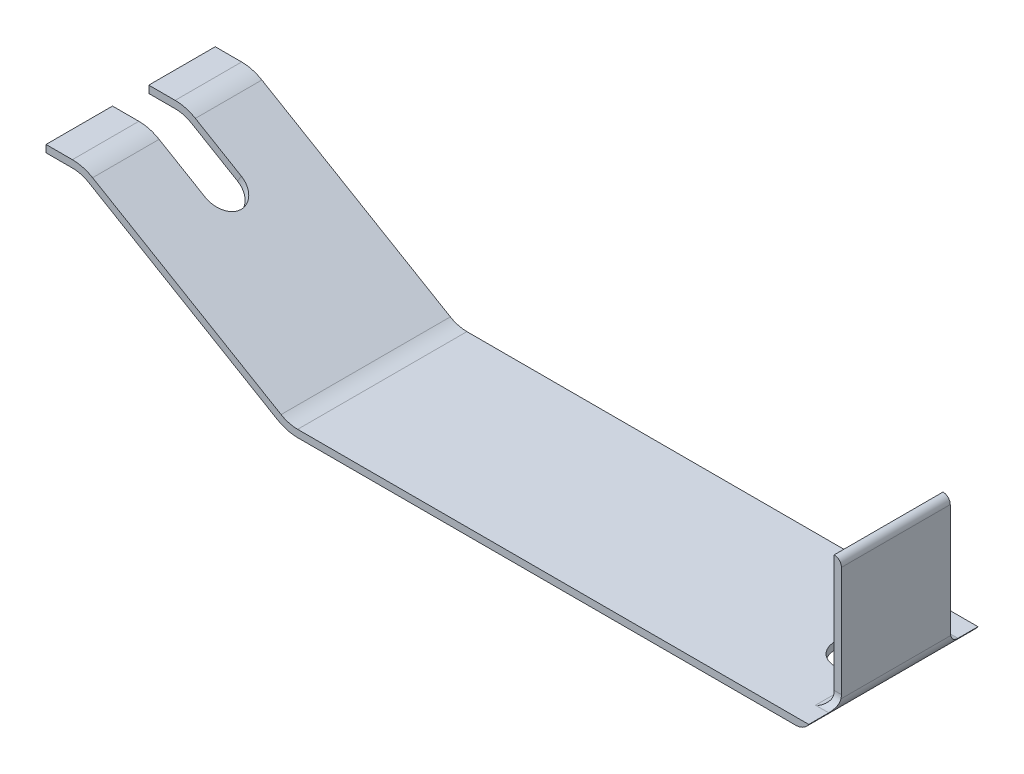
ISO-10303-21;
HEADER;
FILE_DESCRIPTION(('STEP AP214'),'2;1');
FILE_NAME('part.step','',(''),(''),'','','');
FILE_SCHEMA(('AUTOMOTIVE_DESIGN { 1 0 10303 214 1 1 1 1 }'));
ENDSEC;
DATA;
#1=APPLICATION_CONTEXT('core data for automotive mechanical design processes');
#2=APPLICATION_PROTOCOL_DEFINITION('international standard','automotive_design',2000,#1);
#3=PRODUCT_CONTEXT('',#1,'mechanical');
#4=PRODUCT('Part','Part','',(#3));
#5=PRODUCT_RELATED_PRODUCT_CATEGORY('part','',(#4));
#6=PRODUCT_DEFINITION_FORMATION('','',#4);
#7=PRODUCT_DEFINITION_CONTEXT('part definition',#1,'design');
#8=PRODUCT_DEFINITION('design','',#6,#7);
#9=PRODUCT_DEFINITION_SHAPE('','',#8);
#10=(LENGTH_UNIT() NAMED_UNIT(*) SI_UNIT(.MILLI.,.METRE.));
#11=(NAMED_UNIT(*) PLANE_ANGLE_UNIT() SI_UNIT($,.RADIAN.));
#12=(NAMED_UNIT(*) SI_UNIT($,.STERADIAN.) SOLID_ANGLE_UNIT());
#13=UNCERTAINTY_MEASURE_WITH_UNIT(LENGTH_MEASURE(1.E-05),#10,'distance_accuracy_value','');
#14=(GEOMETRIC_REPRESENTATION_CONTEXT(3) GLOBAL_UNCERTAINTY_ASSIGNED_CONTEXT((#13)) GLOBAL_UNIT_ASSIGNED_CONTEXT((#10,
#11,#12)) REPRESENTATION_CONTEXT('',''));
#15=CARTESIAN_POINT('',(0.,0.,0.));
#16=DIRECTION('',(0.,0.,1.));
#17=DIRECTION('',(1.,0.,0.));
#18=AXIS2_PLACEMENT_3D('',#15,#16,#17);
#19=CARTESIAN_POINT('',(42.,1.,0.));
#20=DIRECTION('',(0.,0.,1.));
#21=DIRECTION('',(1.,0.,0.));
#22=AXIS2_PLACEMENT_3D('',#19,#20,#21);
#23=CYLINDRICAL_SURFACE('',#22,1.3);
#24=DIRECTION('',(0.,0.,1.));
#25=VECTOR('',#24,1.);
#26=CARTESIAN_POINT('',(43.3,1.,0.));
#27=LINE('',#26,#25);
#28=CARTESIAN_POINT('',(43.3,1.,2.45777149874087));
#29=VERTEX_POINT('',#28);
#30=CARTESIAN_POINT('',(43.3,1.,11.5422285012591));
#31=VERTEX_POINT('',#30);
#32=EDGE_CURVE('E260',#29,#31,#27,.T.);
#33=ORIENTED_EDGE('',*,*,#32,.T.);
#34=CARTESIAN_POINT('',(43.0954451150103,0.3,12.3425718504636));
#35=CARTESIAN_POINT('',(43.1009860692345,0.308764774140358,12.287481588007));
#36=CARTESIAN_POINT('',(43.1094239996931,0.322089023365338,12.2336268584539));
#37=CARTESIAN_POINT('',(43.1300499596579,0.357018804766384,12.1296925515366));
#38=CARTESIAN_POINT('',(43.142220332528,0.378585461343068,12.0795965532125));
#39=CARTESIAN_POINT('',(43.168306565023,0.429162238240824,11.9841320818381));
#40=CARTESIAN_POINT('',(43.1822156322819,0.458143829129428,11.9387464059531));
#41=CARTESIAN_POINT('',(43.2098828149588,0.523099560251248,11.8530541984881));
#42=CARTESIAN_POINT('',(43.2236405156638,0.559089436417627,11.8127594398203));
#43=CARTESIAN_POINT('',(43.2500892259129,0.640491159120319,11.7353206773618));
#44=CARTESIAN_POINT('',(43.2626182635572,0.686412987398169,11.6986530998893));
#45=CARTESIAN_POINT('',(43.283006936711,0.784632851589829,11.6336685842594));
#46=CARTESIAN_POINT('',(43.2908846427387,0.83690524754826,11.6053195473879));
#47=CARTESIAN_POINT('',(43.2969407065136,0.909100362109296,11.5741682781272));
#48=CARTESIAN_POINT('',(43.2980758530731,0.927002297797336,11.5670518805544));
#49=CARTESIAN_POINT('',(43.2996052602428,0.963212298070906,11.5538564354973));
#50=CARTESIAN_POINT('',(43.2999996245098,0.98152030547248,11.5477772429864));
#51=CARTESIAN_POINT('',(43.3000000000001,0.999999999999972,11.5422285012591));
#52=B_SPLINE_CURVE_WITH_KNOTS('',3,(#34,#35,#36,#37,#38,#39,#40,#41,#42,#43,#44,#45,#46,#47,#48,
#49,#50,#51),.UNSPECIFIED.,.F.,.F.,(4,2,2,2,2,2,2,2,4),(0.,0.167603080934095,0.334425221703443,
0.50061491095816,0.667182145969951,0.846484237801725,1.02508507407689,1.08294273050189,
1.14079229036877),.UNSPECIFIED.);
#53=CARTESIAN_POINT('',(43.0954451150103,0.3,12.3425718504636));
#54=VERTEX_POINT('',#53);
#55=EDGE_CURVE('E549',#54,#31,#52,.T.);
#56=ORIENTED_EDGE('',*,*,#55,.F.);
#57=DIRECTION('',(0.,0.,1.));
#58=VECTOR('',#57,1.);
#59=CARTESIAN_POINT('',(43.0954451150103,0.300000000000003,0.));
#60=LINE('',#59,#58);
#61=CARTESIAN_POINT('',(43.0954451150103,0.3,14.));
#62=VERTEX_POINT('',#61);
#63=EDGE_CURVE('E567',#62,#54,#60,.F.);
#64=ORIENTED_EDGE('',*,*,#63,.F.);
#65=CARTESIAN_POINT('',(42.,1.,14.));
#66=DIRECTION('',(0.,0.,1.));
#67=DIRECTION('',(1.,0.,0.));
#68=AXIS2_PLACEMENT_3D('',#65,#66,#67);
#69=CIRCLE('',#68,1.3);
#70=CARTESIAN_POINT('',(42.,-0.3,14.));
#71=VERTEX_POINT('',#70);
#72=EDGE_CURVE('E424',#71,#62,#69,.T.);
#73=ORIENTED_EDGE('',*,*,#72,.F.);
#74=DIRECTION('',(0.,0.,-1.));
#75=VECTOR('',#74,1.);
#76=CARTESIAN_POINT('',(42.,-0.3,0.));
#77=LINE('',#76,#75);
#78=CARTESIAN_POINT('',(42.,-0.3,0.));
#79=VERTEX_POINT('',#78);
#80=EDGE_CURVE('E418',#79,#71,#77,.F.);
#81=ORIENTED_EDGE('',*,*,#80,.F.);
#82=CARTESIAN_POINT('',(42.,1.,0.));
#83=DIRECTION('',(0.,0.,1.));
#84=DIRECTION('',(1.,0.,0.));
#85=AXIS2_PLACEMENT_3D('',#82,#83,#84);
#86=CIRCLE('',#85,1.3);
#87=CARTESIAN_POINT('',(43.0954451150103,0.300000000000002,0.));
#88=VERTEX_POINT('',#87);
#89=EDGE_CURVE('E406',#79,#88,#86,.T.);
#90=ORIENTED_EDGE('',*,*,#89,.T.);
#91=DIRECTION('',(0.,0.,1.));
#92=VECTOR('',#91,1.);
#93=CARTESIAN_POINT('',(43.0954451150103,0.300000000000002,0.));
#94=LINE('',#93,#92);
#95=CARTESIAN_POINT('',(43.0954451150103,0.300000000000002,1.65742814953642));
#96=VERTEX_POINT('',#95);
#97=EDGE_CURVE('E411',#96,#88,#94,.F.);
#98=ORIENTED_EDGE('',*,*,#97,.F.);
#99=CARTESIAN_POINT('',(43.3,1.,2.45777149874087));
#100=CARTESIAN_POINT('',(43.300003060125,0.974977084683495,2.45026207106213));
#101=CARTESIAN_POINT('',(43.2992771391845,0.950269281489994,2.44177243800736));
#102=CARTESIAN_POINT('',(43.296504152437,0.901678397363534,2.42292788347146));
#103=CARTESIAN_POINT('',(43.2944583741159,0.877794536589449,2.41257478683843));
#104=CARTESIAN_POINT('',(43.2865861393163,0.807973512023601,2.37901843177275));
#105=CARTESIAN_POINT('',(43.2790203173852,0.763460035455825,2.35319459337139));
#106=CARTESIAN_POINT('',(43.2606192433438,0.679556234527645,2.29558524613177));
#107=CARTESIAN_POINT('',(43.249795538377,0.640148507833617,2.26382094066309));
#108=CARTESIAN_POINT('',(43.2262838172361,0.566736725567431,2.19497835862495));
#109=CARTESIAN_POINT('',(43.2135906625276,0.532748119586755,2.15788544251204));
#110=CARTESIAN_POINT('',(43.1864843685304,0.467425517456522,2.07489982129071));
#111=CARTESIAN_POINT('',(43.1720324167227,0.436763721716948,2.02849030088368));
#112=CARTESIAN_POINT('',(43.1448780305091,0.383437153198706,1.93091909753384));
#113=CARTESIAN_POINT('',(43.1321710671408,0.36075143065257,1.87977031649505));
#114=CARTESIAN_POINT('',(43.115880289925,0.332967751353762,1.79941268843545));
#115=CARTESIAN_POINT('',(43.1108582329345,0.324672516905738,1.77157271034746));
#116=CARTESIAN_POINT('',(43.1021117789649,0.310496458709886,1.71506819450864));
#117=CARTESIAN_POINT('',(43.0983882503688,0.304617250198115,1.68640311879419));
#118=CARTESIAN_POINT('',(43.0954451150103,0.3,1.65742814953642));
#119=B_SPLINE_CURVE_WITH_KNOTS('',3,(#99,#100,#101,#102,#103,#104,#105,#106,#107,#108,#109,#110,
#111,#112,#113,#114,#115,#116,#117,#118),.UNSPECIFIED.,.F.,.F.,(4,2,2,2,2,2,2,2,2,4),(0.,
0.0783106331794562,0.156544991666629,0.311757085520621,0.466425401834058,0.621527074210314,
0.793209335561477,0.964437231037074,1.05275427306834,1.14113026384572),.UNSPECIFIED.);
#120=EDGE_CURVE('E414',#29,#96,#119,.T.);
#121=ORIENTED_EDGE('',*,*,#120,.F.);
#122=EDGE_LOOP('',(#33,#56,#64,#73,#81,#90,#98,#121));
#123=FACE_BOUND('',#122,.T.);
#124=ADVANCED_FACE('F38',(#123),#23,.T.);
#125=CARTESIAN_POINT('',(43.3,1.,0.));
#126=DIRECTION('',(1.,0.,0.));
#127=DIRECTION('',(0.,0.,-1.));
#128=AXIS2_PLACEMENT_3D('',#125,#126,#127);
#129=PLANE('',#128);
#130=DIRECTION('',(0.,-1.,0.));
#131=VECTOR('',#130,1.);
#132=CARTESIAN_POINT('',(43.3,11.,2.5));
#133=LINE('',#132,#131);
#134=CARTESIAN_POINT('',(43.3,10.4,2.5));
#135=VERTEX_POINT('',#134);
#136=CARTESIAN_POINT('',(43.3,1.28753044395276,2.5));
#137=VERTEX_POINT('',#136);
#138=EDGE_CURVE('E415',#135,#137,#133,.T.);
#139=ORIENTED_EDGE('',*,*,#138,.F.);
#140=DIRECTION('',(0.,0.,1.));
#141=VECTOR('',#140,1.);
#142=CARTESIAN_POINT('',(43.3,10.4,0.));
#143=LINE('',#142,#141);
#144=CARTESIAN_POINT('',(43.3,10.4,11.5));
#145=VERTEX_POINT('',#144);
#146=EDGE_CURVE('E589',#135,#145,#143,.T.);
#147=ORIENTED_EDGE('',*,*,#146,.T.);
#148=DIRECTION('',(0.,1.,0.));
#149=VECTOR('',#148,1.);
#150=CARTESIAN_POINT('',(43.3,11.,11.5));
#151=LINE('',#150,#149);
#152=CARTESIAN_POINT('',(43.3,1.28753044395276,11.5));
#153=VERTEX_POINT('',#152);
#154=EDGE_CURVE('E232',#153,#145,#151,.T.);
#155=ORIENTED_EDGE('',*,*,#154,.F.);
#156=CARTESIAN_POINT('',(43.3,1.28753044395276,12.5));
#157=DIRECTION('',(1.,0.,0.));
#158=DIRECTION('',(0.,0.,-1.));
#159=AXIS2_PLACEMENT_3D('',#156,#157,#158);
#160=CIRCLE('',#159,1.);
#161=EDGE_CURVE('E565',#31,#153,#160,.T.);
#162=ORIENTED_EDGE('',*,*,#161,.F.);
#163=ORIENTED_EDGE('',*,*,#32,.F.);
#164=CARTESIAN_POINT('',(43.3,1.28753044395276,1.5));
#165=DIRECTION('',(1.,0.,0.));
#166=DIRECTION('',(0.,0.,-1.));
#167=AXIS2_PLACEMENT_3D('',#164,#165,#166);
#168=CIRCLE('',#167,1.);
#169=EDGE_CURVE('E559',#137,#29,#168,.T.);
#170=ORIENTED_EDGE('',*,*,#169,.F.);
#171=EDGE_LOOP('',(#139,#147,#155,#162,#163,#170));
#172=FACE_BOUND('',#171,.T.);
#173=ADVANCED_FACE('F347',(#172),#129,.T.);
#174=CARTESIAN_POINT('',(42.,1.,0.));
#175=DIRECTION('',(0.,0.,1.));
#176=DIRECTION('',(1.,0.,0.));
#177=AXIS2_PLACEMENT_3D('',#174,#175,#176);
#178=CYLINDRICAL_SURFACE('',#177,0.700000000000001);
#179=CARTESIAN_POINT('',(42.,0.299999999999999,12.3425718504636));
#180=CARTESIAN_POINT('',(42.0082671688723,0.299995896922403,12.3426148162508));
#181=CARTESIAN_POINT('',(42.016445399232,0.300146051722727,12.3416525751868));
#182=CARTESIAN_POINT('',(42.0322727612088,0.300701824903668,12.3382178786788));
#183=CARTESIAN_POINT('',(42.039929949478,0.301101088728223,12.3357830340655));
#184=CARTESIAN_POINT('',(42.0591022603857,0.302398680647721,12.3281387462741));
#185=CARTESIAN_POINT('',(42.0702720613727,0.303452203146212,12.3221391921365));
#186=CARTESIAN_POINT('',(42.0918526033366,0.305966768221613,12.3087376489384));
#187=CARTESIAN_POINT('',(42.1022494524299,0.307433684075794,12.301315981323));
#188=CARTESIAN_POINT('',(42.1325484024816,0.312356927927091,12.2779971001142));
#189=CARTESIAN_POINT('',(42.1515444093356,0.316334538385715,12.261054188378));
#190=CARTESIAN_POINT('',(42.1883691778079,0.325556949346465,12.2262508669126));
#191=CARTESIAN_POINT('',(42.2061948406816,0.33080495408348,12.2083882285581));
#192=CARTESIAN_POINT('',(42.2410491297342,0.342555369536174,12.1723097733962));
#193=CARTESIAN_POINT('',(42.2580781181319,0.349057203157093,12.1540941225247));
#194=CARTESIAN_POINT('',(42.2914936275288,0.363320609345235,12.1176121463793));
#195=CARTESIAN_POINT('',(42.3078807960458,0.371080869427718,12.099345893184));
#196=CARTESIAN_POINT('',(42.3465736130751,0.391283042252389,12.0555538240414));
#197=CARTESIAN_POINT('',(42.3686043338669,0.404351615801702,12.0300676276901));
#198=CARTESIAN_POINT('',(42.4114813800762,0.433122563719225,11.9795827179245));
#199=CARTESIAN_POINT('',(42.432326887311,0.44882672864448,11.9545843489044));
#200=CARTESIAN_POINT('',(42.492737670775,0.500008103977207,11.8808250689131));
#201=CARTESIAN_POINT('',(42.5303283681808,0.539630533967062,11.8331274063893));
#202=CARTESIAN_POINT('',(42.5846341065337,0.613426394061018,11.7602885542055));
#203=CARTESIAN_POINT('',(42.6038841238276,0.644047487952639,11.7334091618438));
#204=CARTESIAN_POINT('',(42.6380721736154,0.709775616109948,11.682741626101));
#205=CARTESIAN_POINT('',(42.653026477448,0.744864976046498,11.6589420106369));
#206=CARTESIAN_POINT('',(42.6761062152612,0.815334511004535,11.6176664761179));
#207=CARTESIAN_POINT('',(42.6847882229816,0.850288029184428,11.5997873999204));
#208=CARTESIAN_POINT('',(42.693754174822,0.904865461161289,11.5758956232861));
#209=CARTESIAN_POINT('',(42.6960679190162,0.923519745174694,11.5683878598846));
#210=CARTESIAN_POINT('',(42.6991928991913,0.961383548492767,11.5544647032352));
#211=CARTESIAN_POINT('',(42.7000019649449,0.98059382925875,11.5480508999102));
#212=CARTESIAN_POINT('',(42.7,1.,11.5422285012591));
#213=B_SPLINE_CURVE_WITH_KNOTS('',3,(#179,#180,#181,#182,#183,#184,#185,#186,#187,#188,#189,
#190,#191,#192,#193,#194,#195,#196,#197,#198,#199,#200,#201,#202,#203,#204,#205,#206,#207,#208,
#209,#210,#211,#212),.UNSPECIFIED.,.F.,.F.,(4,2,2,2,2,2,2,2,2,2,2,2,2,2,2,2,4),(0.,
0.0246050273330727,0.0486067102397544,0.0865629538847223,0.125088290646698,0.202188380893157,
0.279484999986879,0.356746126626757,0.433927185447177,0.542197927366697,0.650542525800229,
0.866514465606263,1.00128539584072,1.1355388972891,1.25553434681174,1.31617379843645,
1.37690064390883),.UNSPECIFIED.);
#214=CARTESIAN_POINT('',(42.,0.3,12.3425718504636));
#215=VERTEX_POINT('',#214);
#216=CARTESIAN_POINT('',(42.7,1.,11.5422285012591));
#217=VERTEX_POINT('',#216);
#218=EDGE_CURVE('E225',#215,#217,#213,.T.);
#219=ORIENTED_EDGE('',*,*,#218,.T.);
#220=DIRECTION('',(0.,0.,1.));
#221=VECTOR('',#220,1.);
#222=CARTESIAN_POINT('',(42.7,1.,0.));
#223=LINE('',#222,#221);
#224=CARTESIAN_POINT('',(42.7,1.,2.45777149874087));
#225=VERTEX_POINT('',#224);
#226=EDGE_CURVE('E239',#225,#217,#223,.T.);
#227=ORIENTED_EDGE('',*,*,#226,.F.);
#228=CARTESIAN_POINT('',(42.7,1.,2.45777149874087));
#229=CARTESIAN_POINT('',(42.7000017468966,0.980817316137713,2.45201586131585));
#230=CARTESIAN_POINT('',(42.6992113377957,0.961826222006064,2.44568285512556));
#231=CARTESIAN_POINT('',(42.6961567002448,0.924384321100811,2.4319446921043));
#232=CARTESIAN_POINT('',(42.6938944148519,0.905932835487362,2.42454095877161));
#233=CARTESIAN_POINT('',(42.6851172644909,0.851889642785815,2.40097125100585));
#234=CARTESIAN_POINT('',(42.676607778935,0.817242900146227,2.38333534780022));
#235=CARTESIAN_POINT('',(42.6552938756045,0.751435905319599,2.34501504700447));
#236=CARTESIAN_POINT('',(42.6425112185645,0.720259034285679,2.32434638678201));
#237=CARTESIAN_POINT('',(42.6135128919321,0.661353192943823,2.2805462271459));
#238=CARTESIAN_POINT('',(42.5972895279735,0.63363217524325,2.25740926654829));
#239=CARTESIAN_POINT('',(42.5519207493715,0.566585316594929,2.19525472255895));
#240=CARTESIAN_POINT('',(42.5207562174734,0.52991695337482,2.15484328121177));
#241=CARTESIAN_POINT('',(42.4537465455491,0.464924135268402,2.07108715561349));
#242=CARTESIAN_POINT('',(42.4178835666707,0.436632893121952,2.02773161186751));
#243=CARTESIAN_POINT('',(42.3609024211588,0.399766338197311,1.96102906623932));
#244=CARTESIAN_POINT('',(42.3410488862543,0.388275909929479,1.93815422951259));
#245=CARTESIAN_POINT('',(42.3004049073138,0.367321809886781,1.89223951835512));
#246=CARTESIAN_POINT('',(42.2796133519689,0.357860622838425,1.8691994768922));
#247=CARTESIAN_POINT('',(42.2371079663338,0.340986386737755,1.82349199352736));
#248=CARTESIAN_POINT('',(42.2153998020191,0.333562419099447,1.80082320298639));
#249=CARTESIAN_POINT('',(42.17054703323,0.320686864703999,1.75638668393231));
#250=CARTESIAN_POINT('',(42.1474065944578,0.315229846362677,1.73461662335646));
#251=CARTESIAN_POINT('',(42.113846193674,0.309263687248648,1.70748395576867));
#252=CARTESIAN_POINT('',(42.1048469312721,0.307833226903037,1.70059434432806));
#253=CARTESIAN_POINT('',(42.0862249802871,0.305266804010306,1.6876189941763));
#254=CARTESIAN_POINT('',(42.0766024700863,0.30413075765925,1.68153302695303));
#255=CARTESIAN_POINT('',(42.0595842419545,0.30250540854047,1.67245370752577));
#256=CARTESIAN_POINT('',(42.0524032843197,0.301924514542707,1.66908305080133));
#257=CARTESIAN_POINT('',(42.0376230237702,0.300973030588817,1.66344025863276));
#258=CARTESIAN_POINT('',(42.030026034318,0.300601386050167,1.66116262328712));
#259=CARTESIAN_POINT('',(42.0186221043436,0.300238149206491,1.65891655803511));
#260=CARTESIAN_POINT('',(42.0149313913961,0.300149496279634,1.65836382360925));
#261=CARTESIAN_POINT('',(42.0074950409416,0.300030137984798,1.65761724329676));
#262=CARTESIAN_POINT('',(42.0037492230939,0.299999718138794,1.65742516583082));
#263=CARTESIAN_POINT('',(42.,0.299999999999999,1.65742814953641));
#264=B_SPLINE_CURVE_WITH_KNOTS('',3,(#228,#229,#230,#231,#232,#233,#234,#235,#236,#237,#238,
#239,#240,#241,#242,#243,#244,#245,#246,#247,#248,#249,#250,#251,#252,#253,#254,#255,#256,#257,
#258,#259,#260,#261,#262,#263),.UNSPECIFIED.,.F.,.F.,(4,2,2,2,2,2,2,2,2,2,2,2,2,2,2,2,2,4),(0.,
0.0600279095040793,0.119976735162585,0.238743319567583,0.356914082560902,0.475351948118022,
0.662844923917519,0.851071593975691,0.948196528624551,1.04543971846601,1.1421510701491,
1.23859327677079,1.27283923468623,1.30707543387349,1.33088089920742,1.35456528966714,
1.36574737640007,1.37698415086335),.UNSPECIFIED.);
#265=CARTESIAN_POINT('',(42.,0.3,1.65742814953642));
#266=VERTEX_POINT('',#265);
#267=EDGE_CURVE('E542',#225,#266,#264,.T.);
#268=ORIENTED_EDGE('',*,*,#267,.T.);
#269=DIRECTION('',(0.,0.,-1.));
#270=VECTOR('',#269,1.);
#271=CARTESIAN_POINT('',(42.,0.3,0.));
#272=LINE('',#271,#270);
#273=EDGE_CURVE('E241',#266,#215,#272,.F.);
#274=ORIENTED_EDGE('',*,*,#273,.T.);
#275=EDGE_LOOP('',(#219,#227,#268,#274));
#276=FACE_BOUND('',#275,.T.);
#277=ADVANCED_FACE('F237',(#276),#178,.F.);
#278=CARTESIAN_POINT('',(42.7,1.,0.));
#279=DIRECTION('',(1.,0.,0.));
#280=DIRECTION('',(0.,0.,-1.));
#281=AXIS2_PLACEMENT_3D('',#278,#279,#280);
#282=PLANE('',#281);
#283=CARTESIAN_POINT('',(42.7,1.28753044395276,12.5));
#284=DIRECTION('',(1.,0.,0.));
#285=DIRECTION('',(0.,0.,-1.));
#286=AXIS2_PLACEMENT_3D('',#283,#284,#285);
#287=CIRCLE('',#286,1.);
#288=CARTESIAN_POINT('',(42.7,1.28753044395276,11.5));
#289=VERTEX_POINT('',#288);
#290=EDGE_CURVE('E222',#217,#289,#287,.T.);
#291=ORIENTED_EDGE('',*,*,#290,.T.);
#292=DIRECTION('',(0.,1.,0.));
#293=VECTOR('',#292,1.);
#294=CARTESIAN_POINT('',(42.7,11.,11.5));
#295=LINE('',#294,#293);
#296=CARTESIAN_POINT('',(42.7,11.,11.5));
#297=VERTEX_POINT('',#296);
#298=EDGE_CURVE('E233',#289,#297,#295,.T.);
#299=ORIENTED_EDGE('',*,*,#298,.T.);
#300=DIRECTION('',(0.,0.,-1.));
#301=VECTOR('',#300,1.);
#302=CARTESIAN_POINT('',(42.7,11.,0.));
#303=LINE('',#302,#301);
#304=CARTESIAN_POINT('',(42.7,11.,2.5));
#305=VERTEX_POINT('',#304);
#306=EDGE_CURVE('E247',#305,#297,#303,.F.);
#307=ORIENTED_EDGE('',*,*,#306,.F.);
#308=DIRECTION('',(0.,-1.,0.));
#309=VECTOR('',#308,1.);
#310=CARTESIAN_POINT('',(42.7,11.,2.5));
#311=LINE('',#310,#309);
#312=CARTESIAN_POINT('',(42.7,1.28753044395276,2.5));
#313=VERTEX_POINT('',#312);
#314=EDGE_CURVE('E557',#305,#313,#311,.T.);
#315=ORIENTED_EDGE('',*,*,#314,.T.);
#316=CARTESIAN_POINT('',(42.7,1.28753044395276,1.5));
#317=DIRECTION('',(1.,0.,0.));
#318=DIRECTION('',(0.,0.,-1.));
#319=AXIS2_PLACEMENT_3D('',#316,#317,#318);
#320=CIRCLE('',#319,1.);
#321=EDGE_CURVE('E246',#313,#225,#320,.T.);
#322=ORIENTED_EDGE('',*,*,#321,.T.);
#323=ORIENTED_EDGE('',*,*,#226,.T.);
#324=EDGE_LOOP('',(#291,#299,#307,#315,#322,#323));
#325=FACE_BOUND('',#324,.T.);
#326=ADVANCED_FACE('F244',(#325),#282,.F.);
#327=CARTESIAN_POINT('',(-20.,10.,14.));
#328=DIRECTION('',(0.,0.,-1.));
#329=DIRECTION('',(1.,0.,0.));
#330=AXIS2_PLACEMENT_3D('',#327,#328,#329);
#331=PLANE('',#330);
#332=ORIENTED_EDGE('',*,*,#72,.T.);
#333=DIRECTION('',(1.,0.,0.));
#334=VECTOR('',#333,1.);
#335=CARTESIAN_POINT('',(0.816924876994807,0.3,14.));
#336=LINE('',#335,#334);
#337=CARTESIAN_POINT('',(0.816924876994806,0.3,14.));
#338=VERTEX_POINT('',#337);
#339=EDGE_CURVE('E291',#338,#62,#336,.T.);
#340=ORIENTED_EDGE('',*,*,#339,.F.);
#341=CARTESIAN_POINT('',(0.816924876994807,3.,14.));
#342=DIRECTION('',(0.,0.,1.));
#343=DIRECTION('',(1.,0.,0.));
#344=AXIS2_PLACEMENT_3D('',#341,#342,#343);
#345=CIRCLE('',#344,2.7);
#346=CARTESIAN_POINT('',(-0.55202946472635,0.672777619074021,14.));
#347=VERTEX_POINT('',#346);
#348=EDGE_CURVE('E286',#347,#338,#345,.T.);
#349=ORIENTED_EDGE('',*,*,#348,.F.);
#350=DIRECTION('',(0.86193421515777,-0.507020126563394,0.));
#351=VECTOR('',#350,1.);
#352=CARTESIAN_POINT('',(-16.1437584593356,9.84438291002065,14.));
#353=LINE('',#352,#351);
#354=CARTESIAN_POINT('',(-16.1437584593356,9.84438291002064,14.));
#355=VERTEX_POINT('',#354);
#356=EDGE_CURVE('E281',#355,#347,#353,.T.);
#357=ORIENTED_EDGE('',*,*,#356,.F.);
#358=CARTESIAN_POINT('',(-17.8169248769948,7.,14.));
#359=DIRECTION('',(0.,0.,1.));
#360=DIRECTION('',(1.,0.,0.));
#361=AXIS2_PLACEMENT_3D('',#358,#359,#360);
#362=CIRCLE('',#361,3.3);
#363=CARTESIAN_POINT('',(-17.8169248769948,10.3,14.));
#364=VERTEX_POINT('',#363);
#365=EDGE_CURVE('E276',#364,#355,#362,.F.);
#366=ORIENTED_EDGE('',*,*,#365,.F.);
#367=DIRECTION('',(1.,0.,0.));
#368=VECTOR('',#367,1.);
#369=CARTESIAN_POINT('',(-20.,10.3,14.));
#370=LINE('',#369,#368);
#371=CARTESIAN_POINT('',(-20.,10.3,14.));
#372=VERTEX_POINT('',#371);
#373=EDGE_CURVE('E272',#372,#364,#370,.T.);
#374=ORIENTED_EDGE('',*,*,#373,.F.);
#375=DIRECTION('',(0.,-1.,0.));
#376=VECTOR('',#375,1.);
#377=CARTESIAN_POINT('',(-20.,10.,14.));
#378=LINE('',#377,#376);
#379=CARTESIAN_POINT('',(-20.,9.7,14.));
#380=VERTEX_POINT('',#379);
#381=EDGE_CURVE('E598',#372,#380,#378,.T.);
#382=ORIENTED_EDGE('',*,*,#381,.T.);
#383=DIRECTION('',(1.,0.,0.));
#384=VECTOR('',#383,1.);
#385=CARTESIAN_POINT('',(-20.,9.7,14.));
#386=LINE('',#385,#384);
#387=CARTESIAN_POINT('',(-17.8169248769948,9.7,14.));
#388=VERTEX_POINT('',#387);
#389=EDGE_CURVE('E441',#380,#388,#386,.T.);
#390=ORIENTED_EDGE('',*,*,#389,.T.);
#391=CARTESIAN_POINT('',(-17.8169248769948,7.,14.));
#392=DIRECTION('',(0.,0.,1.));
#393=DIRECTION('',(1.,0.,0.));
#394=AXIS2_PLACEMENT_3D('',#391,#392,#393);
#395=CIRCLE('',#394,2.7);
#396=CARTESIAN_POINT('',(-16.4479705352736,9.32722238092598,14.));
#397=VERTEX_POINT('',#396);
#398=EDGE_CURVE('E437',#388,#397,#395,.F.);
#399=ORIENTED_EDGE('',*,*,#398,.T.);
#400=DIRECTION('',(0.86193421515777,-0.507020126563394,0.));
#401=VECTOR('',#400,1.);
#402=CARTESIAN_POINT('',(-16.4479705352736,9.32722238092598,14.));
#403=LINE('',#402,#401);
#404=CARTESIAN_POINT('',(-0.856241540664389,0.155617089979358,14.));
#405=VERTEX_POINT('',#404);
#406=EDGE_CURVE('E433',#397,#405,#403,.T.);
#407=ORIENTED_EDGE('',*,*,#406,.T.);
#408=CARTESIAN_POINT('',(0.816924876994807,3.,14.));
#409=DIRECTION('',(0.,0.,1.));
#410=DIRECTION('',(1.,0.,0.));
#411=AXIS2_PLACEMENT_3D('',#408,#409,#410);
#412=CIRCLE('',#411,3.3);
#413=CARTESIAN_POINT('',(0.816924876994806,-0.3,14.));
#414=VERTEX_POINT('',#413);
#415=EDGE_CURVE('E430',#405,#414,#412,.T.);
#416=ORIENTED_EDGE('',*,*,#415,.T.);
#417=DIRECTION('',(1.,0.,0.));
#418=VECTOR('',#417,1.);
#419=CARTESIAN_POINT('',(0.816924876994807,-0.3,14.));
#420=LINE('',#419,#418);
#421=EDGE_CURVE('E419',#414,#71,#420,.T.);
#422=ORIENTED_EDGE('',*,*,#421,.T.);
#423=EDGE_LOOP('',(#332,#340,#349,#357,#366,#374,#382,#390,#399,#407,#416,#422));
#424=FACE_BOUND('',#423,.T.);
#425=ADVANCED_FACE('F386',(#424),#331,.F.);
#426=CARTESIAN_POINT('',(43.,1.,0.));
#427=DIRECTION('',(0.,0.,-1.));
#428=DIRECTION('',(0.,1.,0.));
#429=AXIS2_PLACEMENT_3D('',#426,#427,#428);
#430=PLANE('',#429);
#431=DIRECTION('',(1.,0.,0.));
#432=VECTOR('',#431,1.);
#433=CARTESIAN_POINT('',(0.816924876994807,0.3,0.));
#434=LINE('',#433,#432);
#435=CARTESIAN_POINT('',(0.816924876994806,0.3,0.));
#436=VERTEX_POINT('',#435);
#437=EDGE_CURVE('E290',#436,#88,#434,.T.);
#438=ORIENTED_EDGE('',*,*,#437,.T.);
#439=ORIENTED_EDGE('',*,*,#89,.F.);
#440=DIRECTION('',(1.,0.,0.));
#441=VECTOR('',#440,1.);
#442=CARTESIAN_POINT('',(0.816924876994807,-0.3,0.));
#443=LINE('',#442,#441);
#444=CARTESIAN_POINT('',(0.816924876994806,-0.3,0.));
#445=VERTEX_POINT('',#444);
#446=EDGE_CURVE('E428',#445,#79,#443,.T.);
#447=ORIENTED_EDGE('',*,*,#446,.F.);
#448=CARTESIAN_POINT('',(0.816924876994807,3.,0.));
#449=DIRECTION('',(0.,0.,1.));
#450=DIRECTION('',(1.,0.,0.));
#451=AXIS2_PLACEMENT_3D('',#448,#449,#450);
#452=CIRCLE('',#451,3.3);
#453=CARTESIAN_POINT('',(-0.856241540664392,0.15561708997936,0.));
#454=VERTEX_POINT('',#453);
#455=EDGE_CURVE('E431',#454,#445,#452,.T.);
#456=ORIENTED_EDGE('',*,*,#455,.F.);
#457=DIRECTION('',(0.86193421515777,-0.507020126563394,0.));
#458=VECTOR('',#457,1.);
#459=CARTESIAN_POINT('',(-16.4479705352736,9.32722238092598,0.));
#460=LINE('',#459,#458);
#461=CARTESIAN_POINT('',(-16.4479705352736,9.32722238092598,0.));
#462=VERTEX_POINT('',#461);
#463=EDGE_CURVE('E435',#462,#454,#460,.T.);
#464=ORIENTED_EDGE('',*,*,#463,.F.);
#465=CARTESIAN_POINT('',(-17.8169248769948,7.,0.));
#466=DIRECTION('',(0.,0.,1.));
#467=DIRECTION('',(1.,0.,0.));
#468=AXIS2_PLACEMENT_3D('',#465,#466,#467);
#469=CIRCLE('',#468,2.7);
#470=CARTESIAN_POINT('',(-17.8169248769948,9.7,0.));
#471=VERTEX_POINT('',#470);
#472=EDGE_CURVE('E439',#471,#462,#469,.F.);
#473=ORIENTED_EDGE('',*,*,#472,.F.);
#474=DIRECTION('',(1.,0.,0.));
#475=VECTOR('',#474,1.);
#476=CARTESIAN_POINT('',(-20.,9.7,0.));
#477=LINE('',#476,#475);
#478=CARTESIAN_POINT('',(-20.,9.7,0.));
#479=VERTEX_POINT('',#478);
#480=EDGE_CURVE('E443',#479,#471,#477,.T.);
#481=ORIENTED_EDGE('',*,*,#480,.F.);
#482=DIRECTION('',(0.,-1.,0.));
#483=VECTOR('',#482,1.);
#484=CARTESIAN_POINT('',(-20.,10.,0.));
#485=LINE('',#484,#483);
#486=CARTESIAN_POINT('',(-20.,10.3,0.));
#487=VERTEX_POINT('',#486);
#488=EDGE_CURVE('E597',#487,#479,#485,.T.);
#489=ORIENTED_EDGE('',*,*,#488,.F.);
#490=DIRECTION('',(1.,0.,0.));
#491=VECTOR('',#490,1.);
#492=CARTESIAN_POINT('',(-20.,10.3,0.));
#493=LINE('',#492,#491);
#494=CARTESIAN_POINT('',(-17.8169248769948,10.3,0.));
#495=VERTEX_POINT('',#494);
#496=EDGE_CURVE('E303',#487,#495,#493,.T.);
#497=ORIENTED_EDGE('',*,*,#496,.T.);
#498=CARTESIAN_POINT('',(-17.8169248769948,7.,0.));
#499=DIRECTION('',(0.,0.,1.));
#500=DIRECTION('',(1.,0.,0.));
#501=AXIS2_PLACEMENT_3D('',#498,#499,#500);
#502=CIRCLE('',#501,3.3);
#503=CARTESIAN_POINT('',(-16.1437584593356,9.84438291002065,0.));
#504=VERTEX_POINT('',#503);
#505=EDGE_CURVE('E275',#495,#504,#502,.F.);
#506=ORIENTED_EDGE('',*,*,#505,.T.);
#507=DIRECTION('',(0.86193421515777,-0.507020126563394,0.));
#508=VECTOR('',#507,1.);
#509=CARTESIAN_POINT('',(-16.1437584593356,9.84438291002065,0.));
#510=LINE('',#509,#508);
#511=CARTESIAN_POINT('',(-0.552029464726356,0.672777619074022,0.));
#512=VERTEX_POINT('',#511);
#513=EDGE_CURVE('E280',#504,#512,#510,.T.);
#514=ORIENTED_EDGE('',*,*,#513,.T.);
#515=CARTESIAN_POINT('',(0.816924876994807,3.,0.));
#516=DIRECTION('',(0.,0.,1.));
#517=DIRECTION('',(1.,0.,0.));
#518=AXIS2_PLACEMENT_3D('',#515,#516,#517);
#519=CIRCLE('',#518,2.7);
#520=EDGE_CURVE('E285',#512,#436,#519,.T.);
#521=ORIENTED_EDGE('',*,*,#520,.T.);
#522=EDGE_LOOP('',(#438,#439,#447,#456,#464,#473,#481,#489,#497,#506,#514,#521));
#523=FACE_BOUND('',#522,.T.);
#524=ADVANCED_FACE('F393',(#523),#430,.T.);
#525=CARTESIAN_POINT('',(-20.,10.,5.5));
#526=DIRECTION('',(0.,0.,1.));
#527=DIRECTION('',(-1.,0.,0.));
#528=AXIS2_PLACEMENT_3D('',#525,#526,#527);
#529=PLANE('',#528);
#530=DIRECTION('',(1.,0.,0.));
#531=VECTOR('',#530,1.);
#532=CARTESIAN_POINT('',(-20.,9.7,5.5));
#533=LINE('',#532,#531);
#534=CARTESIAN_POINT('',(-17.8169248769948,9.7,5.5));
#535=VERTEX_POINT('',#534);
#536=CARTESIAN_POINT('',(-20.,9.7,5.5));
#537=VERTEX_POINT('',#536);
#538=EDGE_CURVE('E450',#535,#537,#533,.F.);
#539=ORIENTED_EDGE('',*,*,#538,.F.);
#540=CARTESIAN_POINT('',(-17.8169248769948,7.,5.5));
#541=DIRECTION('',(0.,0.,1.));
#542=DIRECTION('',(1.,0.,0.));
#543=AXIS2_PLACEMENT_3D('',#540,#541,#542);
#544=CIRCLE('',#543,2.7);
#545=CARTESIAN_POINT('',(-16.4479705352736,9.32722238092598,5.5));
#546=VERTEX_POINT('',#545);
#547=EDGE_CURVE('E453',#546,#535,#544,.T.);
#548=ORIENTED_EDGE('',*,*,#547,.F.);
#549=DIRECTION('',(0.86193421515777,-0.507020126563394,0.));
#550=VECTOR('',#549,1.);
#551=CARTESIAN_POINT('',(-16.4479705352736,9.32722238092598,5.5));
#552=LINE('',#551,#550);
#553=CARTESIAN_POINT('',(-12.652106037969,7.09436091192326,5.5));
#554=VERTEX_POINT('',#553);
#555=EDGE_CURVE('E455',#554,#546,#552,.F.);
#556=ORIENTED_EDGE('',*,*,#555,.F.);
#557=DIRECTION('',(-0.507020126563394,-0.861934215157769,0.));
#558=VECTOR('',#557,1.);
#559=CARTESIAN_POINT('',(-12.5,7.35294117647059,5.5));
#560=LINE('',#559,#558);
#561=CARTESIAN_POINT('',(-12.347893962031,7.61152144101793,5.5));
#562=VERTEX_POINT('',#561);
#563=EDGE_CURVE('E590',#562,#554,#560,.T.);
#564=ORIENTED_EDGE('',*,*,#563,.F.);
#565=DIRECTION('',(0.86193421515777,-0.507020126563394,0.));
#566=VECTOR('',#565,1.);
#567=CARTESIAN_POINT('',(-16.1437584593356,9.84438291002065,5.5));
#568=LINE('',#567,#566);
#569=CARTESIAN_POINT('',(-16.1437584593356,9.84438291002065,5.5));
#570=VERTEX_POINT('',#569);
#571=EDGE_CURVE('E315',#562,#570,#568,.F.);
#572=ORIENTED_EDGE('',*,*,#571,.T.);
#573=CARTESIAN_POINT('',(-17.8169248769948,7.,5.5));
#574=DIRECTION('',(0.,0.,1.));
#575=DIRECTION('',(1.,0.,0.));
#576=AXIS2_PLACEMENT_3D('',#573,#574,#575);
#577=CIRCLE('',#576,3.3);
#578=CARTESIAN_POINT('',(-17.8169248769948,10.3,5.5));
#579=VERTEX_POINT('',#578);
#580=EDGE_CURVE('E312',#570,#579,#577,.T.);
#581=ORIENTED_EDGE('',*,*,#580,.T.);
#582=DIRECTION('',(1.,0.,0.));
#583=VECTOR('',#582,1.);
#584=CARTESIAN_POINT('',(-20.,10.3,5.5));
#585=LINE('',#584,#583);
#586=CARTESIAN_POINT('',(-20.,10.3,5.5));
#587=VERTEX_POINT('',#586);
#588=EDGE_CURVE('E309',#579,#587,#585,.F.);
#589=ORIENTED_EDGE('',*,*,#588,.T.);
#590=DIRECTION('',(0.,-1.,0.));
#591=VECTOR('',#590,1.);
#592=CARTESIAN_POINT('',(-20.,10.,5.5));
#593=LINE('',#592,#591);
#594=EDGE_CURVE('E592',#587,#537,#593,.T.);
#595=ORIENTED_EDGE('',*,*,#594,.T.);
#596=EDGE_LOOP('',(#539,#548,#556,#564,#572,#581,#589,#595));
#597=FACE_BOUND('',#596,.T.);
#598=ADVANCED_FACE('F333',(#597),#529,.T.);
#599=CARTESIAN_POINT('',(-20.,10.,0.));
#600=DIRECTION('',(1.,0.,0.));
#601=DIRECTION('',(0.,0.,1.));
#602=AXIS2_PLACEMENT_3D('',#599,#600,#601);
#603=PLANE('',#602);
#604=ORIENTED_EDGE('',*,*,#594,.F.);
#605=DIRECTION('',(0.,0.,-1.));
#606=VECTOR('',#605,1.);
#607=CARTESIAN_POINT('',(-20.,10.3,0.));
#608=LINE('',#607,#606);
#609=EDGE_CURVE('E271',#487,#587,#608,.F.);
#610=ORIENTED_EDGE('',*,*,#609,.F.);
#611=ORIENTED_EDGE('',*,*,#488,.T.);
#612=DIRECTION('',(0.,0.,-1.));
#613=VECTOR('',#612,1.);
#614=CARTESIAN_POINT('',(-20.,9.7,0.));
#615=LINE('',#614,#613);
#616=EDGE_CURVE('E446',#479,#537,#615,.F.);
#617=ORIENTED_EDGE('',*,*,#616,.T.);
#618=EDGE_LOOP('',(#604,#610,#611,#617));
#619=FACE_BOUND('',#618,.T.);
#620=ADVANCED_FACE('F390',(#619),#603,.F.);
#621=ORIENTED_EDGE('',*,*,#381,.F.);
#622=DIRECTION('',(0.,0.,-1.));
#623=VECTOR('',#622,1.);
#624=CARTESIAN_POINT('',(-20.,10.3,0.));
#625=LINE('',#624,#623);
#626=CARTESIAN_POINT('',(-20.,10.3,8.5));
#627=VERTEX_POINT('',#626);
#628=EDGE_CURVE('E268',#627,#372,#625,.F.);
#629=ORIENTED_EDGE('',*,*,#628,.F.);
#630=DIRECTION('',(0.,-1.,0.));
#631=VECTOR('',#630,1.);
#632=CARTESIAN_POINT('',(-20.,10.,8.5));
#633=LINE('',#632,#631);
#634=CARTESIAN_POINT('',(-20.,9.7,8.5));
#635=VERTEX_POINT('',#634);
#636=EDGE_CURVE('E324',#627,#635,#633,.T.);
#637=ORIENTED_EDGE('',*,*,#636,.T.);
#638=DIRECTION('',(0.,0.,-1.));
#639=VECTOR('',#638,1.);
#640=CARTESIAN_POINT('',(-20.,9.7,0.));
#641=LINE('',#640,#639);
#642=EDGE_CURVE('E449',#635,#380,#641,.F.);
#643=ORIENTED_EDGE('',*,*,#642,.T.);
#644=EDGE_LOOP('',(#621,#629,#637,#643));
#645=FACE_BOUND('',#644,.T.);
#646=ADVANCED_FACE('F341',(#645),#603,.F.);
#647=CARTESIAN_POINT('',(-16.2958644973046,9.58580264547331,8.5));
#648=DIRECTION('',(0.,0.,-1.));
#649=DIRECTION('',(0.86193421515777,-0.507020126563394,0.));
#650=AXIS2_PLACEMENT_3D('',#647,#648,#649);
#651=PLANE('',#650);
#652=DIRECTION('',(0.86193421515777,-0.507020126563394,0.));
#653=VECTOR('',#652,1.);
#654=CARTESIAN_POINT('',(-16.4479705352736,9.32722238092598,8.5));
#655=LINE('',#654,#653);
#656=CARTESIAN_POINT('',(-16.4479705352736,9.32722238092598,8.5));
#657=VERTEX_POINT('',#656);
#658=CARTESIAN_POINT('',(-12.652106037969,7.09436091192326,8.5));
#659=VERTEX_POINT('',#658);
#660=EDGE_CURVE('E478',#657,#659,#655,.T.);
#661=ORIENTED_EDGE('',*,*,#660,.F.);
#662=CARTESIAN_POINT('',(-17.8169248769948,7.,8.5));
#663=DIRECTION('',(0.,0.,1.));
#664=DIRECTION('',(1.,0.,0.));
#665=AXIS2_PLACEMENT_3D('',#662,#663,#664);
#666=CIRCLE('',#665,2.7);
#667=CARTESIAN_POINT('',(-17.8169248769948,9.7,8.5));
#668=VERTEX_POINT('',#667);
#669=EDGE_CURVE('E482',#668,#657,#666,.F.);
#670=ORIENTED_EDGE('',*,*,#669,.F.);
#671=DIRECTION('',(1.,0.,0.));
#672=VECTOR('',#671,1.);
#673=CARTESIAN_POINT('',(-20.,9.7,8.5));
#674=LINE('',#673,#672);
#675=EDGE_CURVE('E460',#635,#668,#674,.T.);
#676=ORIENTED_EDGE('',*,*,#675,.F.);
#677=ORIENTED_EDGE('',*,*,#636,.F.);
#678=DIRECTION('',(1.,0.,0.));
#679=VECTOR('',#678,1.);
#680=CARTESIAN_POINT('',(-20.,10.3,8.5));
#681=LINE('',#680,#679);
#682=CARTESIAN_POINT('',(-17.8169248769948,10.3,8.5));
#683=VERTEX_POINT('',#682);
#684=EDGE_CURVE('E264',#627,#683,#681,.T.);
#685=ORIENTED_EDGE('',*,*,#684,.T.);
#686=CARTESIAN_POINT('',(-17.8169248769948,7.,8.5));
#687=DIRECTION('',(0.,0.,1.));
#688=DIRECTION('',(1.,0.,0.));
#689=AXIS2_PLACEMENT_3D('',#686,#687,#688);
#690=CIRCLE('',#689,3.3);
#691=CARTESIAN_POINT('',(-16.1437584593356,9.84438291002064,8.5));
#692=VERTEX_POINT('',#691);
#693=EDGE_CURVE('E261',#683,#692,#690,.F.);
#694=ORIENTED_EDGE('',*,*,#693,.T.);
#695=DIRECTION('',(0.86193421515777,-0.507020126563394,0.));
#696=VECTOR('',#695,1.);
#697=CARTESIAN_POINT('',(-16.1437584593356,9.84438291002065,8.5));
#698=LINE('',#697,#696);
#699=CARTESIAN_POINT('',(-12.347893962031,7.61152144101793,8.5));
#700=VERTEX_POINT('',#699);
#701=EDGE_CURVE('E257',#692,#700,#698,.T.);
#702=ORIENTED_EDGE('',*,*,#701,.T.);
#703=DIRECTION('',(-0.507020126563394,-0.861934215157769,0.));
#704=VECTOR('',#703,1.);
#705=CARTESIAN_POINT('',(-12.5,7.35294117647059,8.5));
#706=LINE('',#705,#704);
#707=EDGE_CURVE('E481',#700,#659,#706,.T.);
#708=ORIENTED_EDGE('',*,*,#707,.T.);
#709=EDGE_LOOP('',(#661,#670,#676,#677,#685,#694,#702,#708));
#710=FACE_BOUND('',#709,.T.);
#711=ADVANCED_FACE('F336',(#710),#651,.T.);
#712=CARTESIAN_POINT('',(40.,0.,7.));
#713=DIRECTION('',(0.,-1.,0.));
#714=DIRECTION('',(0.,0.,-1.));
#715=AXIS2_PLACEMENT_3D('',#712,#713,#714);
#716=CYLINDRICAL_SURFACE('',#715,1.75);
#717=CARTESIAN_POINT('',(40.,-0.3,7.));
#718=DIRECTION('',(0.,-1.,0.));
#719=DIRECTION('',(0.,0.,-1.));
#720=AXIS2_PLACEMENT_3D('',#717,#718,#719);
#721=CIRCLE('',#720,1.75);
#722=CARTESIAN_POINT('',(40.,-0.3,5.25));
#723=VERTEX_POINT('',#722);
#724=EDGE_CURVE('E445',#723,#723,#721,.T.);
#725=ORIENTED_EDGE('',*,*,#724,.T.);
#726=EDGE_LOOP('',(#725));
#727=FACE_BOUND('',#726,.T.);
#728=CARTESIAN_POINT('',(40.,0.3,7.));
#729=DIRECTION('',(0.,-1.,0.));
#730=DIRECTION('',(0.,0.,-1.));
#731=AXIS2_PLACEMENT_3D('',#728,#729,#730);
#732=CIRCLE('',#731,1.75);
#733=CARTESIAN_POINT('',(40.,0.3,5.25));
#734=VERTEX_POINT('',#733);
#735=EDGE_CURVE('E306',#734,#734,#732,.T.);
#736=ORIENTED_EDGE('',*,*,#735,.F.);
#737=EDGE_LOOP('',(#736));
#738=FACE_BOUND('',#737,.T.);
#739=ADVANCED_FACE('F331',(#727,#738),#716,.F.);
#740=CARTESIAN_POINT('',(-12.5,7.35294117647059,7.));
#741=DIRECTION('',(-0.507020126563394,-0.861934215157769,0.));
#742=DIRECTION('',(-0.86193421515777,0.507020126563394,0.));
#743=AXIS2_PLACEMENT_3D('',#740,#741,#742);
#744=ELLIPSE('',#743,1.74027202264553,1.5);
#745=DIRECTION('',(-0.507020126563394,-0.861934215157769,0.));
#746=VECTOR('',#745,1.);
#747=SURFACE_OF_LINEAR_EXTRUSION('',#744,#746);
#748=CARTESIAN_POINT('',(-12.347893962031,7.61152144101793,7.));
#749=DIRECTION('',(-0.507020126563394,-0.861934215157769,0.));
#750=DIRECTION('',(-0.86193421515777,0.507020126563394,0.));
#751=AXIS2_PLACEMENT_3D('',#748,#749,#750);
#752=ELLIPSE('',#751,1.74027202264553,1.5);
#753=EDGE_CURVE('E267',#700,#562,#752,.F.);
#754=ORIENTED_EDGE('',*,*,#753,.T.);
#755=ORIENTED_EDGE('',*,*,#563,.T.);
#756=CARTESIAN_POINT('',(-12.652106037969,7.09436091192326,7.));
#757=DIRECTION('',(-0.507020126563394,-0.861934215157769,0.));
#758=DIRECTION('',(-0.86193421515777,0.507020126563394,0.));
#759=AXIS2_PLACEMENT_3D('',#756,#757,#758);
#760=ELLIPSE('',#759,1.74027202264553,1.5);
#761=EDGE_CURVE('E457',#659,#554,#760,.F.);
#762=ORIENTED_EDGE('',*,*,#761,.F.);
#763=ORIENTED_EDGE('',*,*,#707,.F.);
#764=EDGE_LOOP('',(#754,#755,#762,#763));
#765=FACE_BOUND('',#764,.T.);
#766=ADVANCED_FACE('F327',(#765),#747,.F.);
#767=CARTESIAN_POINT('',(-16.4479705352736,9.32722238092598,0.));
#768=DIRECTION('',(-0.507020126563394,-0.861934215157769,0.));
#769=DIRECTION('',(0.86193421515777,-0.507020126563394,0.));
#770=AXIS2_PLACEMENT_3D('',#767,#768,#769);
#771=PLANE('',#770);
#772=DIRECTION('',(0.,0.,1.));
#773=VECTOR('',#772,1.);
#774=CARTESIAN_POINT('',(-16.4479705352736,9.32722238092598,0.));
#775=LINE('',#774,#773);
#776=EDGE_CURVE('E494',#657,#397,#775,.T.);
#777=ORIENTED_EDGE('',*,*,#776,.F.);
#778=ORIENTED_EDGE('',*,*,#660,.T.);
#779=ORIENTED_EDGE('',*,*,#761,.T.);
#780=ORIENTED_EDGE('',*,*,#555,.T.);
#781=DIRECTION('',(0.,0.,1.));
#782=VECTOR('',#781,1.);
#783=CARTESIAN_POINT('',(-16.4479705352736,9.32722238092598,0.));
#784=LINE('',#783,#782);
#785=EDGE_CURVE('E438',#462,#546,#784,.T.);
#786=ORIENTED_EDGE('',*,*,#785,.F.);
#787=ORIENTED_EDGE('',*,*,#463,.T.);
#788=DIRECTION('',(0.,0.,1.));
#789=VECTOR('',#788,1.);
#790=CARTESIAN_POINT('',(-0.856241540664389,0.155617089979358,0.));
#791=LINE('',#790,#789);
#792=EDGE_CURVE('E434',#454,#405,#791,.T.);
#793=ORIENTED_EDGE('',*,*,#792,.T.);
#794=ORIENTED_EDGE('',*,*,#406,.F.);
#795=EDGE_LOOP('',(#777,#778,#779,#780,#786,#787,#793,#794));
#796=FACE_BOUND('',#795,.T.);
#797=ADVANCED_FACE('F330',(#796),#771,.T.);
#798=CARTESIAN_POINT('',(-17.8169248769948,7.,0.));
#799=DIRECTION('',(0.,0.,1.));
#800=DIRECTION('',(1.,0.,0.));
#801=AXIS2_PLACEMENT_3D('',#798,#799,#800);
#802=CYLINDRICAL_SURFACE('',#801,2.7);
#803=DIRECTION('',(0.,0.,-1.));
#804=VECTOR('',#803,1.);
#805=CARTESIAN_POINT('',(-17.8169248769948,9.7,0.));
#806=LINE('',#805,#804);
#807=EDGE_CURVE('E491',#668,#388,#806,.F.);
#808=ORIENTED_EDGE('',*,*,#807,.F.);
#809=ORIENTED_EDGE('',*,*,#669,.T.);
#810=ORIENTED_EDGE('',*,*,#776,.T.);
#811=ORIENTED_EDGE('',*,*,#398,.F.);
#812=EDGE_LOOP('',(#808,#809,#810,#811));
#813=FACE_BOUND('',#812,.T.);
#814=ADVANCED_FACE('F610',(#813),#802,.F.);
#815=CARTESIAN_POINT('',(-20.,9.7,0.));
#816=DIRECTION('',(0.,-1.,0.));
#817=DIRECTION('',(0.,0.,-1.));
#818=AXIS2_PLACEMENT_3D('',#815,#816,#817);
#819=PLANE('',#818);
#820=ORIENTED_EDGE('',*,*,#642,.F.);
#821=ORIENTED_EDGE('',*,*,#675,.T.);
#822=ORIENTED_EDGE('',*,*,#807,.T.);
#823=ORIENTED_EDGE('',*,*,#389,.F.);
#824=EDGE_LOOP('',(#820,#821,#822,#823));
#825=FACE_BOUND('',#824,.T.);
#826=ADVANCED_FACE('F606',(#825),#819,.T.);
#827=ORIENTED_EDGE('',*,*,#785,.T.);
#828=ORIENTED_EDGE('',*,*,#547,.T.);
#829=DIRECTION('',(0.,0.,-1.));
#830=VECTOR('',#829,1.);
#831=CARTESIAN_POINT('',(-17.8169248769948,9.7,0.));
#832=LINE('',#831,#830);
#833=EDGE_CURVE('E442',#471,#535,#832,.F.);
#834=ORIENTED_EDGE('',*,*,#833,.F.);
#835=ORIENTED_EDGE('',*,*,#472,.T.);
#836=EDGE_LOOP('',(#827,#828,#834,#835));
#837=FACE_BOUND('',#836,.T.);
#838=ADVANCED_FACE('F614',(#837),#802,.F.);
#839=ORIENTED_EDGE('',*,*,#833,.T.);
#840=ORIENTED_EDGE('',*,*,#538,.T.);
#841=ORIENTED_EDGE('',*,*,#616,.F.);
#842=ORIENTED_EDGE('',*,*,#480,.T.);
#843=EDGE_LOOP('',(#839,#840,#841,#842));
#844=FACE_BOUND('',#843,.T.);
#845=ADVANCED_FACE('F616',(#844),#819,.T.);
#846=CARTESIAN_POINT('',(0.816924876994807,3.,0.));
#847=DIRECTION('',(0.,0.,1.));
#848=DIRECTION('',(1.,0.,0.));
#849=AXIS2_PLACEMENT_3D('',#846,#847,#848);
#850=CYLINDRICAL_SURFACE('',#849,3.3);
#851=ORIENTED_EDGE('',*,*,#415,.F.);
#852=ORIENTED_EDGE('',*,*,#792,.F.);
#853=ORIENTED_EDGE('',*,*,#455,.T.);
#854=DIRECTION('',(0.,0.,1.));
#855=VECTOR('',#854,1.);
#856=CARTESIAN_POINT('',(0.816924876994806,-0.3,0.));
#857=LINE('',#856,#855);
#858=EDGE_CURVE('E422',#445,#414,#857,.T.);
#859=ORIENTED_EDGE('',*,*,#858,.T.);
#860=EDGE_LOOP('',(#851,#852,#853,#859));
#861=FACE_BOUND('',#860,.T.);
#862=ADVANCED_FACE('F508',(#861),#850,.T.);
#863=CARTESIAN_POINT('',(0.816924876994807,-0.3,0.));
#864=DIRECTION('',(0.,-1.,0.));
#865=DIRECTION('',(0.,0.,-1.));
#866=AXIS2_PLACEMENT_3D('',#863,#864,#865);
#867=PLANE('',#866);
#868=ORIENTED_EDGE('',*,*,#724,.F.);
#869=EDGE_LOOP('',(#868));
#870=FACE_BOUND('',#869,.T.);
#871=ORIENTED_EDGE('',*,*,#421,.F.);
#872=ORIENTED_EDGE('',*,*,#858,.F.);
#873=ORIENTED_EDGE('',*,*,#446,.T.);
#874=ORIENTED_EDGE('',*,*,#80,.T.);
#875=EDGE_LOOP('',(#871,#872,#873,#874));
#876=FACE_BOUND('',#875,.T.);
#877=ADVANCED_FACE('F357',(#870,#876),#867,.T.);
#878=CARTESIAN_POINT('',(-16.1437584593356,9.84438291002065,0.));
#879=DIRECTION('',(-0.507020126563394,-0.861934215157769,0.));
#880=DIRECTION('',(0.86193421515777,-0.507020126563394,0.));
#881=AXIS2_PLACEMENT_3D('',#878,#879,#880);
#882=PLANE('',#881);
#883=DIRECTION('',(0.,0.,1.));
#884=VECTOR('',#883,1.);
#885=CARTESIAN_POINT('',(-16.1437584593356,9.84438291002064,0.));
#886=LINE('',#885,#884);
#887=EDGE_CURVE('E284',#692,#355,#886,.T.);
#888=ORIENTED_EDGE('',*,*,#887,.T.);
#889=ORIENTED_EDGE('',*,*,#356,.T.);
#890=DIRECTION('',(0.,0.,1.));
#891=VECTOR('',#890,1.);
#892=CARTESIAN_POINT('',(-0.55202946472635,0.672777619074021,0.));
#893=LINE('',#892,#891);
#894=EDGE_CURVE('E289',#512,#347,#893,.T.);
#895=ORIENTED_EDGE('',*,*,#894,.F.);
#896=ORIENTED_EDGE('',*,*,#513,.F.);
#897=DIRECTION('',(0.,0.,1.));
#898=VECTOR('',#897,1.);
#899=CARTESIAN_POINT('',(-16.1437584593356,9.84438291002064,0.));
#900=LINE('',#899,#898);
#901=EDGE_CURVE('E299',#504,#570,#900,.T.);
#902=ORIENTED_EDGE('',*,*,#901,.T.);
#903=ORIENTED_EDGE('',*,*,#571,.F.);
#904=ORIENTED_EDGE('',*,*,#753,.F.);
#905=ORIENTED_EDGE('',*,*,#701,.F.);
#906=EDGE_LOOP('',(#888,#889,#895,#896,#902,#903,#904,#905));
#907=FACE_BOUND('',#906,.T.);
#908=ADVANCED_FACE('F360',(#907),#882,.F.);
#909=CARTESIAN_POINT('',(-17.8169248769948,7.,0.));
#910=DIRECTION('',(0.,0.,1.));
#911=DIRECTION('',(1.,0.,0.));
#912=AXIS2_PLACEMENT_3D('',#909,#910,#911);
#913=CYLINDRICAL_SURFACE('',#912,3.3);
#914=DIRECTION('',(0.,0.,-1.));
#915=VECTOR('',#914,1.);
#916=CARTESIAN_POINT('',(-17.8169248769948,10.3,0.));
#917=LINE('',#916,#915);
#918=EDGE_CURVE('E279',#683,#364,#917,.F.);
#919=ORIENTED_EDGE('',*,*,#918,.T.);
#920=ORIENTED_EDGE('',*,*,#365,.T.);
#921=ORIENTED_EDGE('',*,*,#887,.F.);
#922=ORIENTED_EDGE('',*,*,#693,.F.);
#923=EDGE_LOOP('',(#919,#920,#921,#922));
#924=FACE_BOUND('',#923,.T.);
#925=ADVANCED_FACE('F363',(#924),#913,.T.);
#926=CARTESIAN_POINT('',(-20.,10.3,0.));
#927=DIRECTION('',(0.,-1.,0.));
#928=DIRECTION('',(0.,0.,-1.));
#929=AXIS2_PLACEMENT_3D('',#926,#927,#928);
#930=PLANE('',#929);
#931=ORIENTED_EDGE('',*,*,#628,.T.);
#932=ORIENTED_EDGE('',*,*,#373,.T.);
#933=ORIENTED_EDGE('',*,*,#918,.F.);
#934=ORIENTED_EDGE('',*,*,#684,.F.);
#935=EDGE_LOOP('',(#931,#932,#933,#934));
#936=FACE_BOUND('',#935,.T.);
#937=ADVANCED_FACE('F367',(#936),#930,.F.);
#938=ORIENTED_EDGE('',*,*,#901,.F.);
#939=ORIENTED_EDGE('',*,*,#505,.F.);
#940=DIRECTION('',(0.,0.,-1.));
#941=VECTOR('',#940,1.);
#942=CARTESIAN_POINT('',(-17.8169248769948,10.3,0.));
#943=LINE('',#942,#941);
#944=EDGE_CURVE('E302',#495,#579,#943,.F.);
#945=ORIENTED_EDGE('',*,*,#944,.T.);
#946=ORIENTED_EDGE('',*,*,#580,.F.);
#947=EDGE_LOOP('',(#938,#939,#945,#946));
#948=FACE_BOUND('',#947,.T.);
#949=ADVANCED_FACE('F369',(#948),#913,.T.);
#950=ORIENTED_EDGE('',*,*,#944,.F.);
#951=ORIENTED_EDGE('',*,*,#496,.F.);
#952=ORIENTED_EDGE('',*,*,#609,.T.);
#953=ORIENTED_EDGE('',*,*,#588,.F.);
#954=EDGE_LOOP('',(#950,#951,#952,#953));
#955=FACE_BOUND('',#954,.T.);
#956=ADVANCED_FACE('F373',(#955),#930,.F.);
#957=CARTESIAN_POINT('',(0.816924876994807,3.,0.));
#958=DIRECTION('',(0.,0.,1.));
#959=DIRECTION('',(1.,0.,0.));
#960=AXIS2_PLACEMENT_3D('',#957,#958,#959);
#961=CYLINDRICAL_SURFACE('',#960,2.7);
#962=ORIENTED_EDGE('',*,*,#348,.T.);
#963=DIRECTION('',(0.,0.,1.));
#964=VECTOR('',#963,1.);
#965=CARTESIAN_POINT('',(0.816924876994806,0.3,0.));
#966=LINE('',#965,#964);
#967=EDGE_CURVE('E292',#436,#338,#966,.T.);
#968=ORIENTED_EDGE('',*,*,#967,.F.);
#969=ORIENTED_EDGE('',*,*,#520,.F.);
#970=ORIENTED_EDGE('',*,*,#894,.T.);
#971=EDGE_LOOP('',(#962,#968,#969,#970));
#972=FACE_BOUND('',#971,.T.);
#973=ADVANCED_FACE('F374',(#972),#961,.F.);
#974=CARTESIAN_POINT('',(0.816924876994807,0.3,0.));
#975=DIRECTION('',(0.,-1.,0.));
#976=DIRECTION('',(0.,0.,-1.));
#977=AXIS2_PLACEMENT_3D('',#974,#975,#976);
#978=PLANE('',#977);
#979=ORIENTED_EDGE('',*,*,#735,.T.);
#980=EDGE_LOOP('',(#979));
#981=FACE_BOUND('',#980,.T.);
#982=ORIENTED_EDGE('',*,*,#339,.T.);
#983=ORIENTED_EDGE('',*,*,#63,.T.);
#984=DIRECTION('',(-1.,0.,0.));
#985=VECTOR('',#984,1.);
#986=CARTESIAN_POINT('',(43.301,0.3,12.3425718504636));
#987=LINE('',#986,#985);
#988=EDGE_CURVE('E572',#54,#215,#987,.T.);
#989=ORIENTED_EDGE('',*,*,#988,.T.);
#990=ORIENTED_EDGE('',*,*,#273,.F.);
#991=DIRECTION('',(-1.,0.,0.));
#992=VECTOR('',#991,1.);
#993=CARTESIAN_POINT('',(43.301,0.300000000000002,1.65742814953642));
#994=LINE('',#993,#992);
#995=EDGE_CURVE('E252',#96,#266,#994,.T.);
#996=ORIENTED_EDGE('',*,*,#995,.F.);
#997=ORIENTED_EDGE('',*,*,#97,.T.);
#998=ORIENTED_EDGE('',*,*,#437,.F.);
#999=ORIENTED_EDGE('',*,*,#967,.T.);
#1000=EDGE_LOOP('',(#982,#983,#989,#990,#996,#997,#998,#999));
#1001=FACE_BOUND('',#1000,.T.);
#1002=ADVANCED_FACE('F377',(#981,#1001),#978,.F.);
#1003=CARTESIAN_POINT('',(43.301,11.,2.5));
#1004=DIRECTION('',(0.,0.,-1.));
#1005=DIRECTION('',(-1.,0.,0.));
#1006=AXIS2_PLACEMENT_3D('',#1003,#1004,#1005);
#1007=PLANE('',#1006);
#1008=ORIENTED_EDGE('',*,*,#314,.F.);
#1009=CARTESIAN_POINT('',(42.7,10.4,2.5));
#1010=DIRECTION('',(0.,0.,-1.));
#1011=DIRECTION('',(-1.,0.,0.));
#1012=AXIS2_PLACEMENT_3D('',#1009,#1010,#1011);
#1013=CIRCLE('',#1012,0.6);
#1014=EDGE_CURVE('E11',#305,#135,#1013,.T.);
#1015=ORIENTED_EDGE('',*,*,#1014,.T.);
#1016=ORIENTED_EDGE('',*,*,#138,.T.);
#1017=DIRECTION('',(-1.,0.,0.));
#1018=VECTOR('',#1017,1.);
#1019=CARTESIAN_POINT('',(43.301,1.28753044395276,2.5));
#1020=LINE('',#1019,#1018);
#1021=EDGE_CURVE('E248',#137,#313,#1020,.T.);
#1022=ORIENTED_EDGE('',*,*,#1021,.T.);
#1023=EDGE_LOOP('',(#1008,#1015,#1016,#1022));
#1024=FACE_BOUND('',#1023,.T.);
#1025=ADVANCED_FACE('F381',(#1024),#1007,.T.);
#1026=CARTESIAN_POINT('',(43.301,1.28753044395276,1.5));
#1027=DIRECTION('',(-1.,0.,0.));
#1028=DIRECTION('',(0.,0.,1.));
#1029=AXIS2_PLACEMENT_3D('',#1026,#1027,#1028);
#1030=CYLINDRICAL_SURFACE('',#1029,1.);
#1031=ORIENTED_EDGE('',*,*,#120,.T.);
#1032=ORIENTED_EDGE('',*,*,#995,.T.);
#1033=ORIENTED_EDGE('',*,*,#267,.F.);
#1034=ORIENTED_EDGE('',*,*,#321,.F.);
#1035=ORIENTED_EDGE('',*,*,#1021,.F.);
#1036=ORIENTED_EDGE('',*,*,#169,.T.);
#1037=EDGE_LOOP('',(#1031,#1032,#1033,#1034,#1035,#1036));
#1038=FACE_BOUND('',#1037,.T.);
#1039=ADVANCED_FACE('F532',(#1038),#1030,.F.);
#1040=CARTESIAN_POINT('',(43.301,1.28753044395276,12.5));
#1041=DIRECTION('',(-1.,0.,0.));
#1042=DIRECTION('',(0.,0.,1.));
#1043=AXIS2_PLACEMENT_3D('',#1040,#1041,#1042);
#1044=CYLINDRICAL_SURFACE('',#1043,1.);
#1045=ORIENTED_EDGE('',*,*,#55,.T.);
#1046=ORIENTED_EDGE('',*,*,#161,.T.);
#1047=DIRECTION('',(-1.,0.,0.));
#1048=VECTOR('',#1047,1.);
#1049=CARTESIAN_POINT('',(43.301,1.28753044395276,11.5));
#1050=LINE('',#1049,#1048);
#1051=EDGE_CURVE('E228',#153,#289,#1050,.T.);
#1052=ORIENTED_EDGE('',*,*,#1051,.T.);
#1053=ORIENTED_EDGE('',*,*,#290,.F.);
#1054=ORIENTED_EDGE('',*,*,#218,.F.);
#1055=ORIENTED_EDGE('',*,*,#988,.F.);
#1056=EDGE_LOOP('',(#1045,#1046,#1052,#1053,#1054,#1055));
#1057=FACE_BOUND('',#1056,.T.);
#1058=ADVANCED_FACE('F224',(#1057),#1044,.F.);
#1059=CARTESIAN_POINT('',(43.301,11.,11.5));
#1060=DIRECTION('',(0.,0.,1.));
#1061=DIRECTION('',(1.,0.,0.));
#1062=AXIS2_PLACEMENT_3D('',#1059,#1060,#1061);
#1063=PLANE('',#1062);
#1064=ORIENTED_EDGE('',*,*,#154,.T.);
#1065=CARTESIAN_POINT('',(42.7,10.4,11.5));
#1066=DIRECTION('',(0.,0.,1.));
#1067=DIRECTION('',(1.,0.,0.));
#1068=AXIS2_PLACEMENT_3D('',#1065,#1066,#1067);
#1069=CIRCLE('',#1068,0.6);
#1070=EDGE_CURVE('E46',#145,#297,#1069,.T.);
#1071=ORIENTED_EDGE('',*,*,#1070,.T.);
#1072=ORIENTED_EDGE('',*,*,#298,.F.);
#1073=ORIENTED_EDGE('',*,*,#1051,.F.);
#1074=EDGE_LOOP('',(#1064,#1071,#1072,#1073));
#1075=FACE_BOUND('',#1074,.T.);
#1076=ADVANCED_FACE('F581',(#1075),#1063,.T.);
#1077=CARTESIAN_POINT('',(42.7,10.4,0.));
#1078=DIRECTION('',(0.,0.,1.));
#1079=DIRECTION('',(1.,0.,0.));
#1080=AXIS2_PLACEMENT_3D('',#1077,#1078,#1079);
#1081=CYLINDRICAL_SURFACE('',#1080,0.6);
#1082=ORIENTED_EDGE('',*,*,#1014,.F.);
#1083=ORIENTED_EDGE('',*,*,#306,.T.);
#1084=ORIENTED_EDGE('',*,*,#1070,.F.);
#1085=ORIENTED_EDGE('',*,*,#146,.F.);
#1086=EDGE_LOOP('',(#1082,#1083,#1084,#1085));
#1087=FACE_BOUND('',#1086,.T.);
#1088=ADVANCED_FACE('F40',(#1087),#1081,.T.);
#1089=CLOSED_SHELL('',(#124,#173,#277,#326,#425,#524,#598,#620,#646,#711,#739,#766,#797,#814,
#826,#838,#845,#862,#877,#908,#925,#937,#949,#956,#973,#1002,#1025,#1039,#1058,#1076,#1088));
#1090=MANIFOLD_SOLID_BREP('B2',#1089);
#1091=ADVANCED_BREP_SHAPE_REPRESENTATION('',(#18,#1090),#14);
#1092=SHAPE_DEFINITION_REPRESENTATION(#9,#1091);
ENDSEC;
END-ISO-10303-21;
